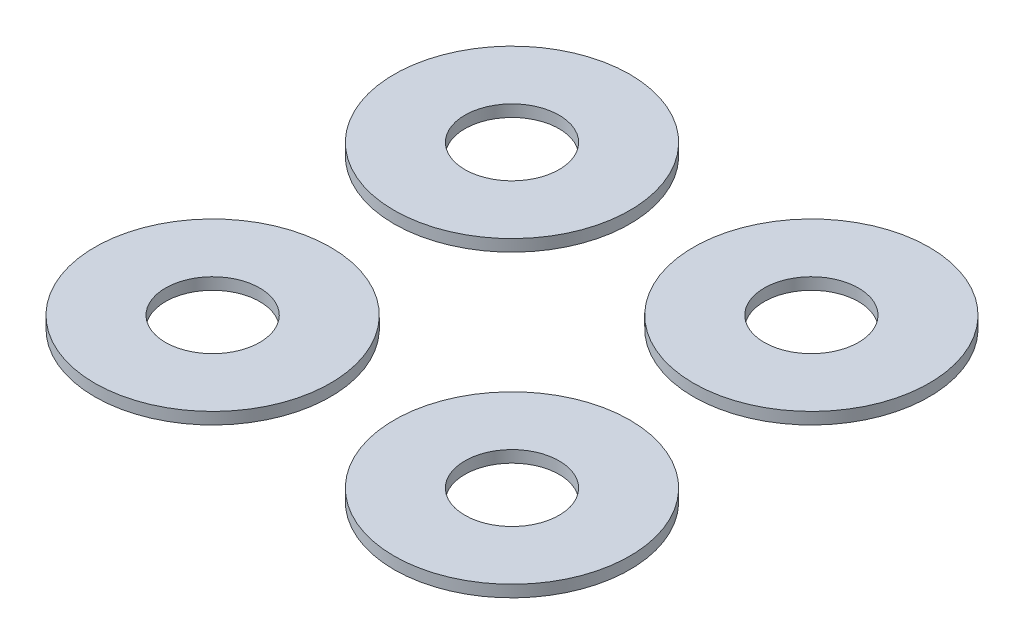
ISO-10303-21;
HEADER;
FILE_DESCRIPTION(('STEP AP214'),'2;1');
FILE_NAME('part.step','',(''),(''),'','','');
FILE_SCHEMA(('AUTOMOTIVE_DESIGN { 1 0 10303 214 1 1 1 1 }'));
ENDSEC;
DATA;
#1=APPLICATION_CONTEXT('core data for automotive mechanical design processes');
#2=APPLICATION_PROTOCOL_DEFINITION('international standard','automotive_design',2000,#1);
#3=PRODUCT_CONTEXT('',#1,'mechanical');
#4=PRODUCT('Part','Part','',(#3));
#5=PRODUCT_RELATED_PRODUCT_CATEGORY('part','',(#4));
#6=PRODUCT_DEFINITION_FORMATION('','',#4);
#7=PRODUCT_DEFINITION_CONTEXT('part definition',#1,'design');
#8=PRODUCT_DEFINITION('design','',#6,#7);
#9=PRODUCT_DEFINITION_SHAPE('','',#8);
#10=(LENGTH_UNIT() NAMED_UNIT(*) SI_UNIT(.MILLI.,.METRE.));
#11=(NAMED_UNIT(*) PLANE_ANGLE_UNIT() SI_UNIT($,.RADIAN.));
#12=(NAMED_UNIT(*) SI_UNIT($,.STERADIAN.) SOLID_ANGLE_UNIT());
#13=UNCERTAINTY_MEASURE_WITH_UNIT(LENGTH_MEASURE(1.E-05),#10,'distance_accuracy_value','');
#14=(GEOMETRIC_REPRESENTATION_CONTEXT(3) GLOBAL_UNCERTAINTY_ASSIGNED_CONTEXT((#13)) GLOBAL_UNIT_ASSIGNED_CONTEXT((#10,
#11,#12)) REPRESENTATION_CONTEXT('',''));
#15=CARTESIAN_POINT('',(0.,0.,0.));
#16=DIRECTION('',(0.,0.,1.));
#17=DIRECTION('',(1.,0.,0.));
#18=AXIS2_PLACEMENT_3D('',#15,#16,#17);
#19=CARTESIAN_POINT('',(2.54,0.1,0.));
#20=DIRECTION('',(0.,1.,0.));
#21=DIRECTION('',(0.,0.,1.));
#22=AXIS2_PLACEMENT_3D('',#19,#20,#21);
#23=PLANE('',#22);
#24=CARTESIAN_POINT('',(2.54,0.1,0.));
#25=DIRECTION('',(0.,1.,0.));
#26=DIRECTION('',(0.,0.,1.));
#27=AXIS2_PLACEMENT_3D('',#24,#25,#26);
#28=CIRCLE('',#27,1.);
#29=CARTESIAN_POINT('',(2.54,0.1,1.));
#30=VERTEX_POINT('',#29);
#31=EDGE_CURVE('E11',#30,#30,#28,.T.);
#32=ORIENTED_EDGE('',*,*,#31,.T.);
#33=EDGE_LOOP('',(#32));
#34=FACE_BOUND('',#33,.T.);
#35=CARTESIAN_POINT('',(2.54,0.1,0.));
#36=DIRECTION('',(0.,1.,0.));
#37=DIRECTION('',(0.,0.,1.));
#38=AXIS2_PLACEMENT_3D('',#35,#36,#37);
#39=CIRCLE('',#38,0.4);
#40=CARTESIAN_POINT('',(2.54,0.1,0.4));
#41=VERTEX_POINT('',#40);
#42=EDGE_CURVE('E50',#41,#41,#39,.T.);
#43=ORIENTED_EDGE('',*,*,#42,.F.);
#44=EDGE_LOOP('',(#43));
#45=FACE_BOUND('',#44,.T.);
#46=ADVANCED_FACE('F39',(#34,#45),#23,.T.);
#47=CARTESIAN_POINT('',(2.54,0.,0.));
#48=DIRECTION('',(0.,1.,0.));
#49=DIRECTION('',(0.,0.,1.));
#50=AXIS2_PLACEMENT_3D('',#47,#48,#49);
#51=PLANE('',#50);
#52=CARTESIAN_POINT('',(2.54,0.,0.));
#53=DIRECTION('',(0.,1.,0.));
#54=DIRECTION('',(0.,0.,1.));
#55=AXIS2_PLACEMENT_3D('',#52,#53,#54);
#56=CIRCLE('',#55,1.);
#57=CARTESIAN_POINT('',(2.54,0.,1.));
#58=VERTEX_POINT('',#57);
#59=EDGE_CURVE('E43',#58,#58,#56,.T.);
#60=ORIENTED_EDGE('',*,*,#59,.F.);
#61=EDGE_LOOP('',(#60));
#62=FACE_BOUND('',#61,.T.);
#63=CARTESIAN_POINT('',(2.54,0.,0.));
#64=DIRECTION('',(0.,1.,0.));
#65=DIRECTION('',(0.,0.,1.));
#66=AXIS2_PLACEMENT_3D('',#63,#64,#65);
#67=CIRCLE('',#66,0.4);
#68=CARTESIAN_POINT('',(2.54,0.,0.4));
#69=VERTEX_POINT('',#68);
#70=EDGE_CURVE('E52',#69,#69,#67,.T.);
#71=ORIENTED_EDGE('',*,*,#70,.T.);
#72=EDGE_LOOP('',(#71));
#73=FACE_BOUND('',#72,.T.);
#74=ADVANCED_FACE('F62',(#62,#73),#51,.F.);
#75=CARTESIAN_POINT('',(2.54,0.1,0.));
#76=DIRECTION('',(0.,-1.,0.));
#77=DIRECTION('',(0.,0.,-1.));
#78=AXIS2_PLACEMENT_3D('',#75,#76,#77);
#79=CYLINDRICAL_SURFACE('',#78,1.);
#80=ORIENTED_EDGE('',*,*,#31,.F.);
#81=EDGE_LOOP('',(#80));
#82=FACE_BOUND('',#81,.T.);
#83=ORIENTED_EDGE('',*,*,#59,.T.);
#84=EDGE_LOOP('',(#83));
#85=FACE_BOUND('',#84,.T.);
#86=ADVANCED_FACE('F41',(#82,#85),#79,.T.);
#87=CARTESIAN_POINT('',(2.54,0.1,0.));
#88=DIRECTION('',(0.,-1.,0.));
#89=DIRECTION('',(0.,0.,-1.));
#90=AXIS2_PLACEMENT_3D('',#87,#88,#89);
#91=CYLINDRICAL_SURFACE('',#90,0.4);
#92=ORIENTED_EDGE('',*,*,#42,.T.);
#93=EDGE_LOOP('',(#92));
#94=FACE_BOUND('',#93,.T.);
#95=ORIENTED_EDGE('',*,*,#70,.F.);
#96=EDGE_LOOP('',(#95));
#97=FACE_BOUND('',#96,.T.);
#98=ADVANCED_FACE('F58',(#94,#97),#91,.F.);
#99=CLOSED_SHELL('',(#46,#74,#86,#98));
#100=MANIFOLD_SOLID_BREP('B2',#99);
#101=CARTESIAN_POINT('',(2.54,0.1,-2.54));
#102=DIRECTION('',(0.,1.,0.));
#103=DIRECTION('',(0.,0.,1.));
#104=AXIS2_PLACEMENT_3D('',#101,#102,#103);
#105=PLANE('',#104);
#106=CARTESIAN_POINT('',(2.54,0.1,-2.54));
#107=DIRECTION('',(0.,1.,0.));
#108=DIRECTION('',(0.,0.,1.));
#109=AXIS2_PLACEMENT_3D('',#106,#107,#108);
#110=CIRCLE('',#109,1.);
#111=CARTESIAN_POINT('',(2.54,0.1,-1.54));
#112=VERTEX_POINT('',#111);
#113=EDGE_CURVE('E38',#112,#112,#110,.T.);
#114=ORIENTED_EDGE('',*,*,#113,.T.);
#115=EDGE_LOOP('',(#114));
#116=FACE_BOUND('',#115,.T.);
#117=CARTESIAN_POINT('',(2.54,0.1,-2.54));
#118=DIRECTION('',(0.,1.,0.));
#119=DIRECTION('',(0.,0.,1.));
#120=AXIS2_PLACEMENT_3D('',#117,#118,#119);
#121=CIRCLE('',#120,0.4);
#122=CARTESIAN_POINT('',(2.54,0.1,-2.14));
#123=VERTEX_POINT('',#122);
#124=EDGE_CURVE('E119',#123,#123,#121,.T.);
#125=ORIENTED_EDGE('',*,*,#124,.F.);
#126=EDGE_LOOP('',(#125));
#127=FACE_BOUND('',#126,.T.);
#128=ADVANCED_FACE('F108',(#116,#127),#105,.T.);
#129=CARTESIAN_POINT('',(2.54,0.,-2.54));
#130=DIRECTION('',(0.,1.,0.));
#131=DIRECTION('',(0.,0.,1.));
#132=AXIS2_PLACEMENT_3D('',#129,#130,#131);
#133=PLANE('',#132);
#134=CARTESIAN_POINT('',(2.54,0.,-2.54));
#135=DIRECTION('',(0.,1.,0.));
#136=DIRECTION('',(0.,0.,1.));
#137=AXIS2_PLACEMENT_3D('',#134,#135,#136);
#138=CIRCLE('',#137,1.);
#139=CARTESIAN_POINT('',(2.54,0.,-1.54));
#140=VERTEX_POINT('',#139);
#141=EDGE_CURVE('E112',#140,#140,#138,.T.);
#142=ORIENTED_EDGE('',*,*,#141,.F.);
#143=EDGE_LOOP('',(#142));
#144=FACE_BOUND('',#143,.T.);
#145=CARTESIAN_POINT('',(2.54,0.,-2.54));
#146=DIRECTION('',(0.,1.,0.));
#147=DIRECTION('',(0.,0.,1.));
#148=AXIS2_PLACEMENT_3D('',#145,#146,#147);
#149=CIRCLE('',#148,0.4);
#150=CARTESIAN_POINT('',(2.54,0.,-2.14));
#151=VERTEX_POINT('',#150);
#152=EDGE_CURVE('E121',#151,#151,#149,.T.);
#153=ORIENTED_EDGE('',*,*,#152,.T.);
#154=EDGE_LOOP('',(#153));
#155=FACE_BOUND('',#154,.T.);
#156=ADVANCED_FACE('F131',(#144,#155),#133,.F.);
#157=CARTESIAN_POINT('',(2.54,0.1,-2.54));
#158=DIRECTION('',(0.,-1.,0.));
#159=DIRECTION('',(0.,0.,-1.));
#160=AXIS2_PLACEMENT_3D('',#157,#158,#159);
#161=CYLINDRICAL_SURFACE('',#160,1.);
#162=ORIENTED_EDGE('',*,*,#113,.F.);
#163=EDGE_LOOP('',(#162));
#164=FACE_BOUND('',#163,.T.);
#165=ORIENTED_EDGE('',*,*,#141,.T.);
#166=EDGE_LOOP('',(#165));
#167=FACE_BOUND('',#166,.T.);
#168=ADVANCED_FACE('F110',(#164,#167),#161,.T.);
#169=CARTESIAN_POINT('',(2.54,0.1,-2.54));
#170=DIRECTION('',(0.,-1.,0.));
#171=DIRECTION('',(0.,0.,-1.));
#172=AXIS2_PLACEMENT_3D('',#169,#170,#171);
#173=CYLINDRICAL_SURFACE('',#172,0.4);
#174=ORIENTED_EDGE('',*,*,#124,.T.);
#175=EDGE_LOOP('',(#174));
#176=FACE_BOUND('',#175,.T.);
#177=ORIENTED_EDGE('',*,*,#152,.F.);
#178=EDGE_LOOP('',(#177));
#179=FACE_BOUND('',#178,.T.);
#180=ADVANCED_FACE('F127',(#176,#179),#173,.F.);
#181=CLOSED_SHELL('',(#128,#156,#168,#180));
#182=MANIFOLD_SOLID_BREP('B6',#181);
#183=CARTESIAN_POINT('',(0.,0.1,-2.54));
#184=DIRECTION('',(0.,1.,0.));
#185=DIRECTION('',(0.,0.,1.));
#186=AXIS2_PLACEMENT_3D('',#183,#184,#185);
#187=PLANE('',#186);
#188=CARTESIAN_POINT('',(0.,0.1,-2.54));
#189=DIRECTION('',(0.,1.,0.));
#190=DIRECTION('',(0.,0.,1.));
#191=AXIS2_PLACEMENT_3D('',#188,#189,#190);
#192=CIRCLE('',#191,1.);
#193=CARTESIAN_POINT('',(0.,0.1,-1.54));
#194=VERTEX_POINT('',#193);
#195=EDGE_CURVE('E107',#194,#194,#192,.T.);
#196=ORIENTED_EDGE('',*,*,#195,.T.);
#197=EDGE_LOOP('',(#196));
#198=FACE_BOUND('',#197,.T.);
#199=CARTESIAN_POINT('',(0.,0.1,-2.54));
#200=DIRECTION('',(0.,1.,0.));
#201=DIRECTION('',(0.,0.,1.));
#202=AXIS2_PLACEMENT_3D('',#199,#200,#201);
#203=CIRCLE('',#202,0.4);
#204=CARTESIAN_POINT('',(0.,0.1,-2.14));
#205=VERTEX_POINT('',#204);
#206=EDGE_CURVE('E187',#205,#205,#203,.T.);
#207=ORIENTED_EDGE('',*,*,#206,.F.);
#208=EDGE_LOOP('',(#207));
#209=FACE_BOUND('',#208,.T.);
#210=ADVANCED_FACE('F176',(#198,#209),#187,.T.);
#211=CARTESIAN_POINT('',(0.,0.,-2.54));
#212=DIRECTION('',(0.,1.,0.));
#213=DIRECTION('',(0.,0.,1.));
#214=AXIS2_PLACEMENT_3D('',#211,#212,#213);
#215=PLANE('',#214);
#216=CARTESIAN_POINT('',(0.,0.,-2.54));
#217=DIRECTION('',(0.,1.,0.));
#218=DIRECTION('',(0.,0.,1.));
#219=AXIS2_PLACEMENT_3D('',#216,#217,#218);
#220=CIRCLE('',#219,1.);
#221=CARTESIAN_POINT('',(0.,0.,-1.54));
#222=VERTEX_POINT('',#221);
#223=EDGE_CURVE('E180',#222,#222,#220,.T.);
#224=ORIENTED_EDGE('',*,*,#223,.F.);
#225=EDGE_LOOP('',(#224));
#226=FACE_BOUND('',#225,.T.);
#227=CARTESIAN_POINT('',(0.,0.,-2.54));
#228=DIRECTION('',(0.,1.,0.));
#229=DIRECTION('',(0.,0.,1.));
#230=AXIS2_PLACEMENT_3D('',#227,#228,#229);
#231=CIRCLE('',#230,0.4);
#232=CARTESIAN_POINT('',(0.,0.,-2.14));
#233=VERTEX_POINT('',#232);
#234=EDGE_CURVE('E189',#233,#233,#231,.T.);
#235=ORIENTED_EDGE('',*,*,#234,.T.);
#236=EDGE_LOOP('',(#235));
#237=FACE_BOUND('',#236,.T.);
#238=ADVANCED_FACE('F199',(#226,#237),#215,.F.);
#239=CARTESIAN_POINT('',(0.,0.1,-2.54));
#240=DIRECTION('',(0.,-1.,0.));
#241=DIRECTION('',(0.,0.,-1.));
#242=AXIS2_PLACEMENT_3D('',#239,#240,#241);
#243=CYLINDRICAL_SURFACE('',#242,1.);
#244=ORIENTED_EDGE('',*,*,#195,.F.);
#245=EDGE_LOOP('',(#244));
#246=FACE_BOUND('',#245,.T.);
#247=ORIENTED_EDGE('',*,*,#223,.T.);
#248=EDGE_LOOP('',(#247));
#249=FACE_BOUND('',#248,.T.);
#250=ADVANCED_FACE('F178',(#246,#249),#243,.T.);
#251=CARTESIAN_POINT('',(0.,0.1,-2.54));
#252=DIRECTION('',(0.,-1.,0.));
#253=DIRECTION('',(0.,0.,-1.));
#254=AXIS2_PLACEMENT_3D('',#251,#252,#253);
#255=CYLINDRICAL_SURFACE('',#254,0.4);
#256=ORIENTED_EDGE('',*,*,#206,.T.);
#257=EDGE_LOOP('',(#256));
#258=FACE_BOUND('',#257,.T.);
#259=ORIENTED_EDGE('',*,*,#234,.F.);
#260=EDGE_LOOP('',(#259));
#261=FACE_BOUND('',#260,.T.);
#262=ADVANCED_FACE('F195',(#258,#261),#255,.F.);
#263=CLOSED_SHELL('',(#210,#238,#250,#262));
#264=MANIFOLD_SOLID_BREP('B33',#263);
#265=CARTESIAN_POINT('',(0.,0.1,0.));
#266=DIRECTION('',(0.,1.,0.));
#267=DIRECTION('',(0.,0.,1.));
#268=AXIS2_PLACEMENT_3D('',#265,#266,#267);
#269=PLANE('',#268);
#270=CARTESIAN_POINT('',(0.,0.1,0.));
#271=DIRECTION('',(0.,1.,0.));
#272=DIRECTION('',(0.,0.,1.));
#273=AXIS2_PLACEMENT_3D('',#270,#271,#272);
#274=CIRCLE('',#273,1.);
#275=CARTESIAN_POINT('',(0.,0.1,1.));
#276=VERTEX_POINT('',#275);
#277=EDGE_CURVE('E175',#276,#276,#274,.T.);
#278=ORIENTED_EDGE('',*,*,#277,.T.);
#279=EDGE_LOOP('',(#278));
#280=FACE_BOUND('',#279,.T.);
#281=CARTESIAN_POINT('',(0.,0.1,0.));
#282=DIRECTION('',(0.,1.,0.));
#283=DIRECTION('',(0.,0.,1.));
#284=AXIS2_PLACEMENT_3D('',#281,#282,#283);
#285=CIRCLE('',#284,0.399999999999999);
#286=CARTESIAN_POINT('',(0.,0.1,0.399999999999999));
#287=VERTEX_POINT('',#286);
#288=EDGE_CURVE('E248',#287,#287,#285,.T.);
#289=ORIENTED_EDGE('',*,*,#288,.F.);
#290=EDGE_LOOP('',(#289));
#291=FACE_BOUND('',#290,.T.);
#292=ADVANCED_FACE('F237',(#280,#291),#269,.T.);
#293=CARTESIAN_POINT('',(0.,0.,0.));
#294=DIRECTION('',(0.,1.,0.));
#295=DIRECTION('',(0.,0.,1.));
#296=AXIS2_PLACEMENT_3D('',#293,#294,#295);
#297=PLANE('',#296);
#298=CARTESIAN_POINT('',(0.,0.,0.));
#299=DIRECTION('',(0.,1.,0.));
#300=DIRECTION('',(0.,0.,1.));
#301=AXIS2_PLACEMENT_3D('',#298,#299,#300);
#302=CIRCLE('',#301,1.);
#303=CARTESIAN_POINT('',(0.,0.,1.));
#304=VERTEX_POINT('',#303);
#305=EDGE_CURVE('E241',#304,#304,#302,.T.);
#306=ORIENTED_EDGE('',*,*,#305,.F.);
#307=EDGE_LOOP('',(#306));
#308=FACE_BOUND('',#307,.T.);
#309=CARTESIAN_POINT('',(0.,0.,0.));
#310=DIRECTION('',(0.,1.,0.));
#311=DIRECTION('',(0.,0.,1.));
#312=AXIS2_PLACEMENT_3D('',#309,#310,#311);
#313=CIRCLE('',#312,0.399999999999999);
#314=CARTESIAN_POINT('',(0.,0.,0.399999999999999));
#315=VERTEX_POINT('',#314);
#316=EDGE_CURVE('E250',#315,#315,#313,.T.);
#317=ORIENTED_EDGE('',*,*,#316,.T.);
#318=EDGE_LOOP('',(#317));
#319=FACE_BOUND('',#318,.T.);
#320=ADVANCED_FACE('F260',(#308,#319),#297,.F.);
#321=CARTESIAN_POINT('',(0.,0.1,0.));
#322=DIRECTION('',(0.,-1.,0.));
#323=DIRECTION('',(0.,0.,-1.));
#324=AXIS2_PLACEMENT_3D('',#321,#322,#323);
#325=CYLINDRICAL_SURFACE('',#324,1.);
#326=ORIENTED_EDGE('',*,*,#277,.F.);
#327=EDGE_LOOP('',(#326));
#328=FACE_BOUND('',#327,.T.);
#329=ORIENTED_EDGE('',*,*,#305,.T.);
#330=EDGE_LOOP('',(#329));
#331=FACE_BOUND('',#330,.T.);
#332=ADVANCED_FACE('F239',(#328,#331),#325,.T.);
#333=CARTESIAN_POINT('',(0.,0.1,0.));
#334=DIRECTION('',(0.,-1.,0.));
#335=DIRECTION('',(0.,0.,-1.));
#336=AXIS2_PLACEMENT_3D('',#333,#334,#335);
#337=CYLINDRICAL_SURFACE('',#336,0.399999999999999);
#338=ORIENTED_EDGE('',*,*,#288,.T.);
#339=EDGE_LOOP('',(#338));
#340=FACE_BOUND('',#339,.T.);
#341=ORIENTED_EDGE('',*,*,#316,.F.);
#342=EDGE_LOOP('',(#341));
#343=FACE_BOUND('',#342,.T.);
#344=ADVANCED_FACE('F256',(#340,#343),#337,.F.);
#345=CLOSED_SHELL('',(#292,#320,#332,#344));
#346=MANIFOLD_SOLID_BREP('B102',#345);
#347=ADVANCED_BREP_SHAPE_REPRESENTATION('',(#18,#100,#182,#264,#346),#14);
#348=SHAPE_DEFINITION_REPRESENTATION(#9,#347);
ENDSEC;
END-ISO-10303-21;
